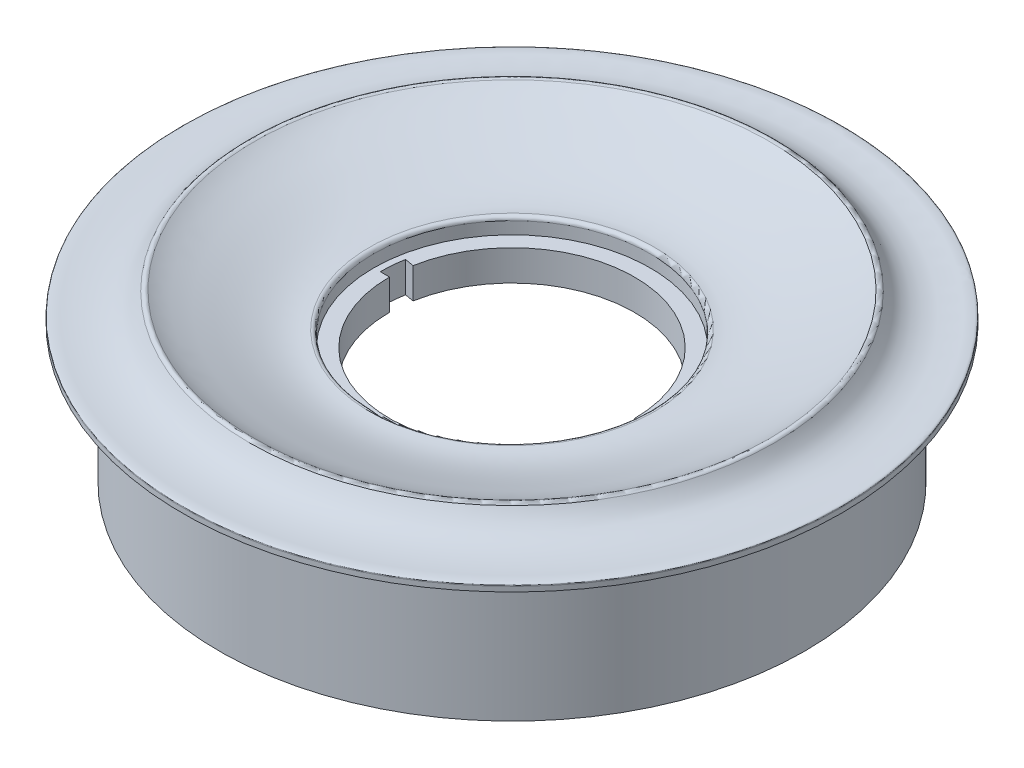
ISO-10303-21;
HEADER;
FILE_DESCRIPTION(('STEP AP214'),'2;1');
FILE_NAME('part.step','',(''),(''),'','','');
FILE_SCHEMA(('AUTOMOTIVE_DESIGN { 1 0 10303 214 1 1 1 1 }'));
ENDSEC;
DATA;
#1=APPLICATION_CONTEXT('core data for automotive mechanical design processes');
#2=APPLICATION_PROTOCOL_DEFINITION('international standard','automotive_design',2000,#1);
#3=PRODUCT_CONTEXT('',#1,'mechanical');
#4=PRODUCT('Part','Part','',(#3));
#5=PRODUCT_RELATED_PRODUCT_CATEGORY('part','',(#4));
#6=PRODUCT_DEFINITION_FORMATION('','',#4);
#7=PRODUCT_DEFINITION_CONTEXT('part definition',#1,'design');
#8=PRODUCT_DEFINITION('design','',#6,#7);
#9=PRODUCT_DEFINITION_SHAPE('','',#8);
#10=(LENGTH_UNIT() NAMED_UNIT(*) SI_UNIT(.MILLI.,.METRE.));
#11=(NAMED_UNIT(*) PLANE_ANGLE_UNIT() SI_UNIT($,.RADIAN.));
#12=(NAMED_UNIT(*) SI_UNIT($,.STERADIAN.) SOLID_ANGLE_UNIT());
#13=UNCERTAINTY_MEASURE_WITH_UNIT(LENGTH_MEASURE(1.E-05),#10,'distance_accuracy_value','');
#14=(GEOMETRIC_REPRESENTATION_CONTEXT(3) GLOBAL_UNCERTAINTY_ASSIGNED_CONTEXT((#13)) GLOBAL_UNIT_ASSIGNED_CONTEXT((#10,
#11,#12)) REPRESENTATION_CONTEXT('',''));
#15=CARTESIAN_POINT('',(0.,0.,0.));
#16=DIRECTION('',(0.,0.,1.));
#17=DIRECTION('',(1.,0.,0.));
#18=AXIS2_PLACEMENT_3D('',#15,#16,#17);
#19=CARTESIAN_POINT('',(0.,6.34999999999999,0.));
#20=DIRECTION('',(0.,1.,0.));
#21=DIRECTION('',(-1.,0.,0.));
#22=AXIS2_PLACEMENT_3D('',#19,#20,#21);
#23=PLANE('',#22);
#24=CARTESIAN_POINT('',(0.,6.34999999999999,0.));
#25=DIRECTION('',(0.,-1.,0.));
#26=DIRECTION('',(1.,0.,0.));
#27=AXIS2_PLACEMENT_3D('',#24,#25,#26);
#28=CIRCLE('',#27,28.6701753059719);
#29=CARTESIAN_POINT('',(28.6701753059719,6.35,0.));
#30=VERTEX_POINT('',#29);
#31=EDGE_CURVE('E198',#30,#30,#28,.T.);
#32=ORIENTED_EDGE('',*,*,#31,.F.);
#33=EDGE_LOOP('',(#32));
#34=FACE_BOUND('',#33,.T.);
#35=CARTESIAN_POINT('',(0.,6.34999999999999,0.));
#36=DIRECTION('',(0.,1.,0.));
#37=DIRECTION('',(-1.,0.,0.));
#38=AXIS2_PLACEMENT_3D('',#35,#36,#37);
#39=CIRCLE('',#38,27.305);
#40=CARTESIAN_POINT('',(26.8763736037759,6.35,4.81908361727159));
#41=VERTEX_POINT('',#40);
#42=CARTESIAN_POINT('',(27.305,6.35,0.));
#43=VERTEX_POINT('',#42);
#44=EDGE_CURVE('E102',#41,#43,#39,.T.);
#45=ORIENTED_EDGE('',*,*,#44,.F.);
#46=DIRECTION('',(-0.984302274447022,0.,-0.17649088508594));
#47=VECTOR('',#46,1.);
#48=CARTESIAN_POINT('',(0.,6.34999999999999,0.));
#49=LINE('',#48,#47);
#50=CARTESIAN_POINT('',(25.0012777709544,6.35,4.48286848118287));
#51=VERTEX_POINT('',#50);
#52=EDGE_CURVE('E110',#41,#51,#49,.T.);
#53=ORIENTED_EDGE('',*,*,#52,.T.);
#54=CARTESIAN_POINT('',(0.,6.34999999999999,0.));
#55=DIRECTION('',(0.,-1.,0.));
#56=DIRECTION('',(1.,0.,0.));
#57=AXIS2_PLACEMENT_3D('',#54,#55,#56);
#58=CIRCLE('',#57,25.4);
#59=CARTESIAN_POINT('',(-25.4,6.34999999999999,0.));
#60=VERTEX_POINT('',#59);
#61=EDGE_CURVE('E232',#51,#60,#58,.T.);
#62=ORIENTED_EDGE('',*,*,#61,.T.);
#63=DIRECTION('',(-1.,0.,0.));
#64=VECTOR('',#63,1.);
#65=CARTESIAN_POINT('',(0.,6.34999999999999,0.));
#66=LINE('',#65,#64);
#67=CARTESIAN_POINT('',(-27.305,6.34999999999999,0.));
#68=VERTEX_POINT('',#67);
#69=EDGE_CURVE('E131',#60,#68,#66,.T.);
#70=ORIENTED_EDGE('',*,*,#69,.T.);
#71=CARTESIAN_POINT('',(0.,6.34999999999999,0.));
#72=DIRECTION('',(0.,1.,0.));
#73=DIRECTION('',(-1.,0.,0.));
#74=AXIS2_PLACEMENT_3D('',#71,#72,#73);
#75=CIRCLE('',#74,27.305);
#76=CARTESIAN_POINT('',(-26.876373603776,6.34999999999999,-4.81908361727159));
#77=VERTEX_POINT('',#76);
#78=EDGE_CURVE('E129',#77,#68,#75,.T.);
#79=ORIENTED_EDGE('',*,*,#78,.F.);
#80=DIRECTION('',(-0.984302274447022,0.,-0.17649088508594));
#81=VECTOR('',#80,1.);
#82=CARTESIAN_POINT('',(0.,6.34999999999999,0.));
#83=LINE('',#82,#81);
#84=CARTESIAN_POINT('',(-25.0012777709544,6.34999999999999,-4.48286848118287));
#85=VERTEX_POINT('',#84);
#86=EDGE_CURVE('E122',#85,#77,#83,.T.);
#87=ORIENTED_EDGE('',*,*,#86,.F.);
#88=CARTESIAN_POINT('',(25.4,6.35,0.));
#89=VERTEX_POINT('',#88);
#90=EDGE_CURVE('E208',#85,#89,#58,.T.);
#91=ORIENTED_EDGE('',*,*,#90,.T.);
#92=DIRECTION('',(-1.,0.,0.));
#93=VECTOR('',#92,1.);
#94=CARTESIAN_POINT('',(0.,6.34999999999999,0.));
#95=LINE('',#94,#93);
#96=EDGE_CURVE('E107',#43,#89,#95,.T.);
#97=ORIENTED_EDGE('',*,*,#96,.F.);
#98=EDGE_LOOP('',(#45,#53,#62,#70,#79,#87,#91,#97));
#99=FACE_BOUND('',#98,.T.);
#100=ADVANCED_FACE('F34',(#34,#99),#23,.T.);
#101=CARTESIAN_POINT('',(0.,-26.8587837837838,0.));
#102=DIRECTION('',(0.,-1.,0.));
#103=DIRECTION('',(1.,0.,0.));
#104=AXIS2_PLACEMENT_3D('',#101,#102,#103);
#105=CYLINDRICAL_SURFACE('',#104,25.4);
#106=ORIENTED_EDGE('',*,*,#61,.F.);
#107=DIRECTION('',(0.,1.,0.));
#108=VECTOR('',#107,1.);
#109=CARTESIAN_POINT('',(25.0012777709544,-19.05,4.48286848118287));
#110=LINE('',#109,#108);
#111=CARTESIAN_POINT('',(25.0012777709544,0.,4.48286848118287));
#112=VERTEX_POINT('',#111);
#113=EDGE_CURVE('E113',#112,#51,#110,.T.);
#114=ORIENTED_EDGE('',*,*,#113,.F.);
#115=CARTESIAN_POINT('',(0.,0.,0.));
#116=DIRECTION('',(0.,-1.,0.));
#117=DIRECTION('',(1.,0.,0.));
#118=AXIS2_PLACEMENT_3D('',#115,#116,#117);
#119=CIRCLE('',#118,25.4);
#120=CARTESIAN_POINT('',(-25.4,0.,0.));
#121=VERTEX_POINT('',#120);
#122=EDGE_CURVE('E230',#112,#121,#119,.T.);
#123=ORIENTED_EDGE('',*,*,#122,.T.);
#124=DIRECTION('',(0.,1.,0.));
#125=VECTOR('',#124,1.);
#126=CARTESIAN_POINT('',(-25.4,-19.05,0.));
#127=LINE('',#126,#125);
#128=EDGE_CURVE('E138',#121,#60,#127,.T.);
#129=ORIENTED_EDGE('',*,*,#128,.T.);
#130=EDGE_LOOP('',(#106,#114,#123,#129));
#131=FACE_BOUND('',#130,.T.);
#132=ADVANCED_FACE('F175',(#131),#105,.F.);
#133=CARTESIAN_POINT('',(0.,0.,0.));
#134=DIRECTION('',(0.,-1.,0.));
#135=DIRECTION('',(1.,0.,0.));
#136=AXIS2_PLACEMENT_3D('',#133,#134,#135);
#137=PLANE('',#136);
#138=CARTESIAN_POINT('',(0.,0.,0.));
#139=DIRECTION('',(0.,-1.,0.));
#140=DIRECTION('',(1.,0.,0.));
#141=AXIS2_PLACEMENT_3D('',#138,#139,#140);
#142=CIRCLE('',#141,27.94);
#143=CARTESIAN_POINT('',(27.94,0.,0.));
#144=VERTEX_POINT('',#143);
#145=EDGE_CURVE('E237',#144,#144,#142,.T.);
#146=ORIENTED_EDGE('',*,*,#145,.T.);
#147=EDGE_LOOP('',(#146));
#148=FACE_BOUND('',#147,.T.);
#149=ORIENTED_EDGE('',*,*,#122,.F.);
#150=DIRECTION('',(0.984302274447023,0.,0.17649088508594));
#151=VECTOR('',#150,1.);
#152=CARTESIAN_POINT('',(0.,0.,0.));
#153=LINE('',#152,#151);
#154=CARTESIAN_POINT('',(26.8763736037759,0.,4.81908361727159));
#155=VERTEX_POINT('',#154);
#156=EDGE_CURVE('E11',#112,#155,#153,.T.);
#157=ORIENTED_EDGE('',*,*,#156,.T.);
#158=CARTESIAN_POINT('',(0.,0.,0.));
#159=DIRECTION('',(0.,-1.,0.));
#160=DIRECTION('',(1.,0.,0.));
#161=AXIS2_PLACEMENT_3D('',#158,#159,#160);
#162=CIRCLE('',#161,27.305);
#163=CARTESIAN_POINT('',(27.305,0.,0.));
#164=VERTEX_POINT('',#163);
#165=EDGE_CURVE('E105',#164,#155,#162,.T.);
#166=ORIENTED_EDGE('',*,*,#165,.F.);
#167=DIRECTION('',(1.,0.,0.));
#168=VECTOR('',#167,1.);
#169=CARTESIAN_POINT('',(0.,0.,0.));
#170=LINE('',#169,#168);
#171=CARTESIAN_POINT('',(25.4,0.,0.));
#172=VERTEX_POINT('',#171);
#173=EDGE_CURVE('E43',#172,#164,#170,.T.);
#174=ORIENTED_EDGE('',*,*,#173,.F.);
#175=CARTESIAN_POINT('',(-25.0012777709544,0.,-4.48286848118287));
#176=VERTEX_POINT('',#175);
#177=EDGE_CURVE('E234',#176,#172,#119,.T.);
#178=ORIENTED_EDGE('',*,*,#177,.F.);
#179=DIRECTION('',(0.984302274447023,0.,0.17649088508594));
#180=VECTOR('',#179,1.);
#181=CARTESIAN_POINT('',(0.,0.,0.));
#182=LINE('',#181,#180);
#183=CARTESIAN_POINT('',(-26.876373603776,0.,-4.81908361727159));
#184=VERTEX_POINT('',#183);
#185=EDGE_CURVE('E221',#184,#176,#182,.T.);
#186=ORIENTED_EDGE('',*,*,#185,.F.);
#187=CARTESIAN_POINT('',(0.,0.,0.));
#188=DIRECTION('',(0.,-1.,0.));
#189=DIRECTION('',(1.,0.,0.));
#190=AXIS2_PLACEMENT_3D('',#187,#188,#189);
#191=CIRCLE('',#190,27.305);
#192=CARTESIAN_POINT('',(-27.305,0.,0.));
#193=VERTEX_POINT('',#192);
#194=EDGE_CURVE('E216',#193,#184,#191,.T.);
#195=ORIENTED_EDGE('',*,*,#194,.F.);
#196=DIRECTION('',(1.,0.,0.));
#197=VECTOR('',#196,1.);
#198=CARTESIAN_POINT('',(0.,0.,0.));
#199=LINE('',#198,#197);
#200=EDGE_CURVE('E218',#193,#121,#199,.T.);
#201=ORIENTED_EDGE('',*,*,#200,.T.);
#202=EDGE_LOOP('',(#149,#157,#166,#174,#178,#186,#195,#201));
#203=FACE_BOUND('',#202,.T.);
#204=ADVANCED_FACE('F170',(#148,#203),#137,.T.);
#205=CARTESIAN_POINT('',(54.4334172981673,16.4923987097209,0.));
#206=CARTESIAN_POINT('',(55.1403293875496,15.4008010122186,0.));
#207=CARTESIAN_POINT('',(56.6341226849523,13.4533803086591,0.));
#208=CARTESIAN_POINT('',(61.084980839576,11.9245329677404,0.));
#209=CARTESIAN_POINT('',(65.0465233733237,12.1539748647627,0.));
#210=CARTESIAN_POINT('',(67.3586956970523,12.3329258300038,0.));
#211=CARTESIAN_POINT('',(68.2555609697031,12.1813969285362,0.));
#212=CARTESIAN_POINT('',(68.3016513023438,11.9856092782213,0.));
#213=B_SPLINE_CURVE_WITH_KNOTS('',3,(#205,#206,#207,#208,#209,#210,#211,#212),.UNSPECIFIED.,.F.,
.F.,(4,1,1,1,1,4),(0.0324838300644104,0.240160522416409,0.498483461622623,0.829405314364627,
0.925193366866748,0.958836686646968),.UNSPECIFIED.);
#214=CARTESIAN_POINT('',(0.,-26.8587837837838,0.));
#215=DIRECTION('',(0.,-1.,0.));
#216=AXIS1_PLACEMENT('',#214,#215);
#217=SURFACE_OF_REVOLUTION('',#213,#216);
#218=CARTESIAN_POINT('',(0.,11.9856092782213,0.));
#219=DIRECTION('',(0.,-1.,0.));
#220=DIRECTION('',(1.,0.,0.));
#221=AXIS2_PLACEMENT_3D('',#218,#219,#220);
#222=CIRCLE('',#221,68.3016513023439);
#223=CARTESIAN_POINT('',(68.3016513023438,11.9856092782213,0.));
#224=VERTEX_POINT('',#223);
#225=EDGE_CURVE('E137',#224,#224,#222,.T.);
#226=ORIENTED_EDGE('',*,*,#225,.F.);
#227=EDGE_LOOP('',(#226));
#228=FACE_BOUND('',#227,.T.);
#229=CARTESIAN_POINT('',(0.,16.4923987097209,0.));
#230=DIRECTION('',(0.,-1.,0.));
#231=DIRECTION('',(1.,0.,0.));
#232=AXIS2_PLACEMENT_3D('',#229,#230,#231);
#233=CIRCLE('',#232,54.4334172981673);
#234=CARTESIAN_POINT('',(54.4334172981673,16.4923987097209,0.));
#235=VERTEX_POINT('',#234);
#236=EDGE_CURVE('E213',#235,#235,#233,.T.);
#237=ORIENTED_EDGE('',*,*,#236,.T.);
#238=EDGE_LOOP('',(#237));
#239=FACE_BOUND('',#238,.T.);
#240=ADVANCED_FACE('F36',(#228,#239),#217,.T.);
#241=CARTESIAN_POINT('',(0.,16.0782,0.));
#242=DIRECTION('',(0.,-1.,0.));
#243=DIRECTION('',(1.,0.,0.));
#244=AXIS2_PLACEMENT_3D('',#241,#242,#243);
#245=TOROIDAL_SURFACE('',#244,53.7938209966883,0.761999999999999);
#246=CARTESIAN_POINT('',(0.,16.7131508980544,0.));
#247=DIRECTION('',(0.,-1.,0.));
#248=DIRECTION('',(1.,0.,0.));
#249=AXIS2_PLACEMENT_3D('',#246,#247,#248);
#250=CIRCLE('',#249,53.3725356337099);
#251=CARTESIAN_POINT('',(53.3725356337099,16.7131508980544,0.));
#252=VERTEX_POINT('',#251);
#253=EDGE_CURVE('E206',#252,#252,#250,.T.);
#254=ORIENTED_EDGE('',*,*,#253,.T.);
#255=EDGE_LOOP('',(#254));
#256=FACE_BOUND('',#255,.T.);
#257=ORIENTED_EDGE('',*,*,#236,.F.);
#258=EDGE_LOOP('',(#257));
#259=FACE_BOUND('',#258,.T.);
#260=ADVANCED_FACE('F162',(#256,#259),#245,.T.);
#261=CARTESIAN_POINT('',(29.5281601562089,9.64593049186085,0.));
#262=CARTESIAN_POINT('',(32.3548326146096,9.28701160247665,0.));
#263=CARTESIAN_POINT('',(37.8008383729279,10.3000250220282,0.));
#264=CARTESIAN_POINT('',(43.8116199334136,12.5138342862572,0.));
#265=CARTESIAN_POINT('',(48.9714829665233,14.4254353909202,0.));
#266=CARTESIAN_POINT('',(51.7719979555551,15.6512056377697,0.));
#267=CARTESIAN_POINT('',(53.3725356337099,16.7131508980544,0.));
#268=B_SPLINE_CURVE_WITH_KNOTS('',3,(#261,#262,#263,#264,#265,#266,#267),.UNSPECIFIED.,.F.,.F.,
(4,1,1,1,4),(0.0307658621855829,0.353803290986322,0.633803768632881,0.758492974897343,
0.975529832886141),.UNSPECIFIED.);
#269=CARTESIAN_POINT('',(0.,-26.8587837837838,0.));
#270=DIRECTION('',(0.,-1.,0.));
#271=AXIS1_PLACEMENT('',#269,#270);
#272=SURFACE_OF_REVOLUTION('',#268,#271);
#273=ORIENTED_EDGE('',*,*,#253,.F.);
#274=EDGE_LOOP('',(#273));
#275=FACE_BOUND('',#274,.T.);
#276=CARTESIAN_POINT('',(0.,9.64593049186085,0.));
#277=DIRECTION('',(0.,-1.,0.));
#278=DIRECTION('',(1.,0.,0.));
#279=AXIS2_PLACEMENT_3D('',#276,#277,#278);
#280=CIRCLE('',#279,29.5281601562089);
#281=CARTESIAN_POINT('',(29.5281601562089,9.64593049186085,0.));
#282=VERTEX_POINT('',#281);
#283=EDGE_CURVE('E203',#282,#282,#280,.T.);
#284=ORIENTED_EDGE('',*,*,#283,.T.);
#285=EDGE_LOOP('',(#284));
#286=FACE_BOUND('',#285,.T.);
#287=ADVANCED_FACE('F158',(#275,#286),#272,.T.);
#288=CARTESIAN_POINT('',(0.,8.88999999999999,0.));
#289=DIRECTION('',(0.,-1.,0.));
#290=DIRECTION('',(1.,0.,0.));
#291=AXIS2_PLACEMENT_3D('',#288,#289,#290);
#292=TOROIDAL_SURFACE('',#291,29.4321753059719,0.762);
#293=ORIENTED_EDGE('',*,*,#283,.F.);
#294=EDGE_LOOP('',(#293));
#295=FACE_BOUND('',#294,.T.);
#296=CARTESIAN_POINT('',(0.,8.89,0.));
#297=DIRECTION('',(0.,-1.,0.));
#298=DIRECTION('',(1.,0.,0.));
#299=AXIS2_PLACEMENT_3D('',#296,#297,#298);
#300=CIRCLE('',#299,28.6701753059719);
#301=CARTESIAN_POINT('',(28.6701753059719,8.89,0.));
#302=VERTEX_POINT('',#301);
#303=EDGE_CURVE('E201',#302,#302,#300,.T.);
#304=ORIENTED_EDGE('',*,*,#303,.T.);
#305=EDGE_LOOP('',(#304));
#306=FACE_BOUND('',#305,.T.);
#307=ADVANCED_FACE('F161',(#295,#306),#292,.T.);
#308=CARTESIAN_POINT('',(0.,-26.8587837837838,0.));
#309=DIRECTION('',(0.,-1.,0.));
#310=DIRECTION('',(1.,0.,0.));
#311=AXIS2_PLACEMENT_3D('',#308,#309,#310);
#312=CYLINDRICAL_SURFACE('',#311,28.6701753059719);
#313=ORIENTED_EDGE('',*,*,#31,.T.);
#314=EDGE_LOOP('',(#313));
#315=FACE_BOUND('',#314,.T.);
#316=ORIENTED_EDGE('',*,*,#303,.F.);
#317=EDGE_LOOP('',(#316));
#318=FACE_BOUND('',#317,.T.);
#319=ADVANCED_FACE('F186',(#315,#318),#312,.F.);
#320=DIRECTION('',(0.,1.,0.));
#321=VECTOR('',#320,1.);
#322=CARTESIAN_POINT('',(25.4,-19.05,0.));
#323=LINE('',#322,#321);
#324=EDGE_CURVE('E123',#172,#89,#323,.T.);
#325=ORIENTED_EDGE('',*,*,#324,.T.);
#326=ORIENTED_EDGE('',*,*,#90,.F.);
#327=DIRECTION('',(0.,1.,0.));
#328=VECTOR('',#327,1.);
#329=CARTESIAN_POINT('',(-25.0012777709544,-19.05,-4.48286848118287));
#330=LINE('',#329,#328);
#331=EDGE_CURVE('E135',#176,#85,#330,.T.);
#332=ORIENTED_EDGE('',*,*,#331,.F.);
#333=ORIENTED_EDGE('',*,*,#177,.T.);
#334=EDGE_LOOP('',(#325,#326,#332,#333));
#335=FACE_BOUND('',#334,.T.);
#336=ADVANCED_FACE('F183',(#335),#105,.F.);
#337=CARTESIAN_POINT('',(0.,-26.8587837837838,0.));
#338=DIRECTION('',(0.,-1.,0.));
#339=DIRECTION('',(1.,0.,0.));
#340=AXIS2_PLACEMENT_3D('',#337,#338,#339);
#341=CYLINDRICAL_SURFACE('',#340,27.94);
#342=CARTESIAN_POINT('',(0.,3.81,0.));
#343=DIRECTION('',(0.,-1.,0.));
#344=DIRECTION('',(1.,0.,0.));
#345=AXIS2_PLACEMENT_3D('',#342,#343,#344);
#346=CIRCLE('',#345,27.94);
#347=CARTESIAN_POINT('',(27.94,3.81,0.));
#348=VERTEX_POINT('',#347);
#349=EDGE_CURVE('E240',#348,#348,#346,.T.);
#350=ORIENTED_EDGE('',*,*,#349,.T.);
#351=EDGE_LOOP('',(#350));
#352=FACE_BOUND('',#351,.T.);
#353=ORIENTED_EDGE('',*,*,#145,.F.);
#354=EDGE_LOOP('',(#353));
#355=FACE_BOUND('',#354,.T.);
#356=ADVANCED_FACE('F193',(#352,#355),#341,.T.);
#357=CARTESIAN_POINT('',(0.,3.80999999999999,0.));
#358=DIRECTION('',(0.,-1.,0.));
#359=DIRECTION('',(1.,0.,0.));
#360=AXIS2_PLACEMENT_3D('',#357,#358,#359);
#361=PLANE('',#360);
#362=CARTESIAN_POINT('',(0.,3.80999999999999,0.));
#363=DIRECTION('',(0.,-1.,0.));
#364=DIRECTION('',(1.,0.,0.));
#365=AXIS2_PLACEMENT_3D('',#362,#363,#364);
#366=CIRCLE('',#365,31.75);
#367=CARTESIAN_POINT('',(31.75,3.81,0.));
#368=VERTEX_POINT('',#367);
#369=EDGE_CURVE('E243',#368,#368,#366,.T.);
#370=ORIENTED_EDGE('',*,*,#369,.T.);
#371=EDGE_LOOP('',(#370));
#372=FACE_BOUND('',#371,.T.);
#373=ORIENTED_EDGE('',*,*,#349,.F.);
#374=EDGE_LOOP('',(#373));
#375=FACE_BOUND('',#374,.T.);
#376=ADVANCED_FACE('F319',(#372,#375),#361,.T.);
#377=CARTESIAN_POINT('',(0.,-26.8587837837838,0.));
#378=DIRECTION('',(0.,-1.,0.));
#379=DIRECTION('',(1.,0.,0.));
#380=AXIS2_PLACEMENT_3D('',#377,#378,#379);
#381=CYLINDRICAL_SURFACE('',#380,31.75);
#382=CARTESIAN_POINT('',(0.,7.61999999999999,0.));
#383=DIRECTION('',(0.,-1.,0.));
#384=DIRECTION('',(1.,0.,0.));
#385=AXIS2_PLACEMENT_3D('',#382,#383,#384);
#386=CIRCLE('',#385,31.75);
#387=CARTESIAN_POINT('',(31.75,7.62,0.));
#388=VERTEX_POINT('',#387);
#389=EDGE_CURVE('E246',#388,#388,#386,.T.);
#390=ORIENTED_EDGE('',*,*,#389,.T.);
#391=EDGE_LOOP('',(#390));
#392=FACE_BOUND('',#391,.T.);
#393=ORIENTED_EDGE('',*,*,#369,.F.);
#394=EDGE_LOOP('',(#393));
#395=FACE_BOUND('',#394,.T.);
#396=ADVANCED_FACE('F315',(#392,#395),#381,.T.);
#397=CARTESIAN_POINT('',(0.,7.61999999999999,0.));
#398=DIRECTION('',(0.,1.,0.));
#399=DIRECTION('',(-1.,0.,0.));
#400=AXIS2_PLACEMENT_3D('',#397,#398,#399);
#401=CONICAL_SURFACE('',#400,31.75,1.2323747869996);
#402=CARTESIAN_POINT('',(0.,15.081797010964,0.));
#403=DIRECTION('',(0.,-1.,0.));
#404=DIRECTION('',(1.,0.,0.));
#405=AXIS2_PLACEMENT_3D('',#402,#403,#404);
#406=CIRCLE('',#405,52.9505819824219);
#407=CARTESIAN_POINT('',(52.9505819824219,15.081797010964,0.));
#408=VERTEX_POINT('',#407);
#409=EDGE_CURVE('E249',#408,#408,#406,.T.);
#410=ORIENTED_EDGE('',*,*,#409,.T.);
#411=EDGE_LOOP('',(#410));
#412=FACE_BOUND('',#411,.T.);
#413=ORIENTED_EDGE('',*,*,#389,.F.);
#414=EDGE_LOOP('',(#413));
#415=FACE_BOUND('',#414,.T.);
#416=ADVANCED_FACE('F311',(#412,#415),#401,.T.);
#417=CARTESIAN_POINT('',(0.,15.081797010964,0.));
#418=DIRECTION('',(0.,-1.,0.));
#419=DIRECTION('',(1.,0.,0.));
#420=AXIS2_PLACEMENT_3D('',#417,#418,#419);
#421=CONICAL_SURFACE('',#420,52.9505819824219,0.901965786478076);
#422=CARTESIAN_POINT('',(0.,10.16,0.));
#423=DIRECTION('',(0.,-1.,0.));
#424=DIRECTION('',(1.,0.,0.));
#425=AXIS2_PLACEMENT_3D('',#422,#423,#424);
#426=CIRCLE('',#425,59.1779265555819);
#427=CARTESIAN_POINT('',(59.1779265555819,10.16,0.));
#428=VERTEX_POINT('',#427);
#429=EDGE_CURVE('E252',#428,#428,#426,.T.);
#430=ORIENTED_EDGE('',*,*,#429,.T.);
#431=EDGE_LOOP('',(#430));
#432=FACE_BOUND('',#431,.T.);
#433=ORIENTED_EDGE('',*,*,#409,.F.);
#434=EDGE_LOOP('',(#433));
#435=FACE_BOUND('',#434,.T.);
#436=ADVANCED_FACE('F307',(#432,#435),#421,.F.);
#437=CARTESIAN_POINT('',(0.,-26.8587837837838,0.));
#438=DIRECTION('',(0.,-1.,0.));
#439=DIRECTION('',(1.,0.,0.));
#440=AXIS2_PLACEMENT_3D('',#437,#438,#439);
#441=CYLINDRICAL_SURFACE('',#440,59.1779265555819);
#442=CARTESIAN_POINT('',(0.,-17.78,0.));
#443=DIRECTION('',(0.,-1.,0.));
#444=DIRECTION('',(1.,0.,0.));
#445=AXIS2_PLACEMENT_3D('',#442,#443,#444);
#446=CIRCLE('',#445,59.1779265555819);
#447=CARTESIAN_POINT('',(59.1779265555819,-17.78,0.));
#448=VERTEX_POINT('',#447);
#449=EDGE_CURVE('E255',#448,#448,#446,.T.);
#450=ORIENTED_EDGE('',*,*,#449,.T.);
#451=EDGE_LOOP('',(#450));
#452=FACE_BOUND('',#451,.T.);
#453=ORIENTED_EDGE('',*,*,#429,.F.);
#454=EDGE_LOOP('',(#453));
#455=FACE_BOUND('',#454,.T.);
#456=ADVANCED_FACE('F303',(#452,#455),#441,.F.);
#457=CARTESIAN_POINT('',(0.,-17.78,0.));
#458=DIRECTION('',(0.,-1.,0.));
#459=DIRECTION('',(1.,0.,0.));
#460=AXIS2_PLACEMENT_3D('',#457,#458,#459);
#461=PLANE('',#460);
#462=CARTESIAN_POINT('',(0.,-17.78,0.));
#463=DIRECTION('',(0.,-1.,0.));
#464=DIRECTION('',(1.,0.,0.));
#465=AXIS2_PLACEMENT_3D('',#462,#463,#464);
#466=CIRCLE('',#465,60.7019265555819);
#467=CARTESIAN_POINT('',(60.7019265555819,-17.78,0.));
#468=VERTEX_POINT('',#467);
#469=EDGE_CURVE('E258',#468,#468,#466,.T.);
#470=ORIENTED_EDGE('',*,*,#469,.T.);
#471=EDGE_LOOP('',(#470));
#472=FACE_BOUND('',#471,.T.);
#473=ORIENTED_EDGE('',*,*,#449,.F.);
#474=EDGE_LOOP('',(#473));
#475=FACE_BOUND('',#474,.T.);
#476=ADVANCED_FACE('F299',(#472,#475),#461,.T.);
#477=CARTESIAN_POINT('',(0.,-26.8587837837838,0.));
#478=DIRECTION('',(0.,-1.,0.));
#479=DIRECTION('',(1.,0.,0.));
#480=AXIS2_PLACEMENT_3D('',#477,#478,#479);
#481=CYLINDRICAL_SURFACE('',#480,60.7019265555819);
#482=CARTESIAN_POINT('',(0.,10.795,0.));
#483=DIRECTION('',(0.,-1.,0.));
#484=DIRECTION('',(1.,0.,0.));
#485=AXIS2_PLACEMENT_3D('',#482,#483,#484);
#486=CIRCLE('',#485,60.7019265555819);
#487=CARTESIAN_POINT('',(60.7019265555819,10.795,0.));
#488=VERTEX_POINT('',#487);
#489=EDGE_CURVE('E261',#488,#488,#486,.T.);
#490=ORIENTED_EDGE('',*,*,#489,.T.);
#491=EDGE_LOOP('',(#490));
#492=FACE_BOUND('',#491,.T.);
#493=ORIENTED_EDGE('',*,*,#469,.F.);
#494=EDGE_LOOP('',(#493));
#495=FACE_BOUND('',#494,.T.);
#496=ADVANCED_FACE('F295',(#492,#495),#481,.T.);
#497=CARTESIAN_POINT('',(0.,10.795,0.));
#498=DIRECTION('',(0.,-1.,0.));
#499=DIRECTION('',(1.,0.,0.));
#500=AXIS2_PLACEMENT_3D('',#497,#498,#499);
#501=PLANE('',#500);
#502=CARTESIAN_POINT('',(0.,10.795,0.));
#503=DIRECTION('',(0.,-1.,0.));
#504=DIRECTION('',(1.,0.,0.));
#505=AXIS2_PLACEMENT_3D('',#502,#503,#504);
#506=CIRCLE('',#505,68.3219265555819);
#507=CARTESIAN_POINT('',(68.3219265555819,10.795,0.));
#508=VERTEX_POINT('',#507);
#509=EDGE_CURVE('E264',#508,#508,#506,.T.);
#510=ORIENTED_EDGE('',*,*,#509,.T.);
#511=EDGE_LOOP('',(#510));
#512=FACE_BOUND('',#511,.T.);
#513=ORIENTED_EDGE('',*,*,#489,.F.);
#514=EDGE_LOOP('',(#513));
#515=FACE_BOUND('',#514,.T.);
#516=ADVANCED_FACE('F288',(#512,#515),#501,.T.);
#517=CARTESIAN_POINT('',(0.,-26.8587837837838,0.));
#518=DIRECTION('',(0.,-1.,0.));
#519=DIRECTION('',(1.,0.,0.));
#520=AXIS2_PLACEMENT_3D('',#517,#518,#519);
#521=CYLINDRICAL_SURFACE('',#520,68.3219265555819);
#522=ORIENTED_EDGE('',*,*,#509,.F.);
#523=EDGE_LOOP('',(#522));
#524=FACE_BOUND('',#523,.T.);
#525=CARTESIAN_POINT('',(0.,11.811,0.));
#526=DIRECTION('',(0.,-1.,0.));
#527=DIRECTION('',(1.,0.,0.));
#528=AXIS2_PLACEMENT_3D('',#525,#526,#527);
#529=CIRCLE('',#528,68.3219265555819);
#530=CARTESIAN_POINT('',(68.3219265555819,11.811,0.));
#531=VERTEX_POINT('',#530);
#532=EDGE_CURVE('E266',#531,#531,#529,.T.);
#533=ORIENTED_EDGE('',*,*,#532,.T.);
#534=EDGE_LOOP('',(#533));
#535=FACE_BOUND('',#534,.T.);
#536=ADVANCED_FACE('F278',(#524,#535),#521,.T.);
#537=CARTESIAN_POINT('',(0.,11.811,0.));
#538=DIRECTION('',(0.,-1.,0.));
#539=DIRECTION('',(1.,0.,0.));
#540=AXIS2_PLACEMENT_3D('',#537,#538,#539);
#541=TOROIDAL_SURFACE('',#540,67.5599265555819,0.762000000000008);
#542=ORIENTED_EDGE('',*,*,#532,.F.);
#543=EDGE_LOOP('',(#542));
#544=FACE_BOUND('',#543,.T.);
#545=ORIENTED_EDGE('',*,*,#225,.T.);
#546=EDGE_LOOP('',(#545));
#547=FACE_BOUND('',#546,.T.);
#548=ADVANCED_FACE('F273',(#544,#547),#541,.T.);
#549=CARTESIAN_POINT('',(0.,-19.05,0.));
#550=DIRECTION('',(0.17649088508594,0.,-0.984302274447022));
#551=DIRECTION('',(-0.984302274447023,0.,-0.17649088508594));
#552=AXIS2_PLACEMENT_3D('',#549,#550,#551);
#553=PLANE('',#552);
#554=ORIENTED_EDGE('',*,*,#185,.T.);
#555=ORIENTED_EDGE('',*,*,#331,.T.);
#556=ORIENTED_EDGE('',*,*,#86,.T.);
#557=DIRECTION('',(0.,1.,0.));
#558=VECTOR('',#557,1.);
#559=CARTESIAN_POINT('',(-26.876373603776,-19.05,-4.81908361727159));
#560=LINE('',#559,#558);
#561=EDGE_CURVE('E134',#184,#77,#560,.T.);
#562=ORIENTED_EDGE('',*,*,#561,.F.);
#563=EDGE_LOOP('',(#554,#555,#556,#562));
#564=FACE_BOUND('',#563,.T.);
#565=ADVANCED_FACE('F277',(#564),#553,.F.);
#566=CARTESIAN_POINT('',(0.,-19.05,0.));
#567=DIRECTION('',(0.,0.,-1.));
#568=DIRECTION('',(-1.,0.,0.));
#569=AXIS2_PLACEMENT_3D('',#566,#567,#568);
#570=PLANE('',#569);
#571=DIRECTION('',(0.,1.,0.));
#572=VECTOR('',#571,1.);
#573=CARTESIAN_POINT('',(-27.305,-19.05,0.));
#574=LINE('',#573,#572);
#575=EDGE_CURVE('E58',#193,#68,#574,.T.);
#576=ORIENTED_EDGE('',*,*,#575,.T.);
#577=ORIENTED_EDGE('',*,*,#69,.F.);
#578=ORIENTED_EDGE('',*,*,#128,.F.);
#579=ORIENTED_EDGE('',*,*,#200,.F.);
#580=EDGE_LOOP('',(#576,#577,#578,#579));
#581=FACE_BOUND('',#580,.T.);
#582=ADVANCED_FACE('F285',(#581),#570,.T.);
#583=CARTESIAN_POINT('',(0.,-19.05,0.));
#584=DIRECTION('',(0.,1.,0.));
#585=DIRECTION('',(-1.,0.,0.));
#586=AXIS2_PLACEMENT_3D('',#583,#584,#585);
#587=CYLINDRICAL_SURFACE('',#586,27.305);
#588=ORIENTED_EDGE('',*,*,#194,.T.);
#589=ORIENTED_EDGE('',*,*,#561,.T.);
#590=ORIENTED_EDGE('',*,*,#78,.T.);
#591=ORIENTED_EDGE('',*,*,#575,.F.);
#592=EDGE_LOOP('',(#588,#589,#590,#591));
#593=FACE_BOUND('',#592,.T.);
#594=ADVANCED_FACE('F449',(#593),#587,.F.);
#595=CARTESIAN_POINT('',(0.,-19.05,0.));
#596=DIRECTION('',(0.17649088508594,0.,-0.984302274447022));
#597=DIRECTION('',(-0.984302274447023,0.,-0.17649088508594));
#598=AXIS2_PLACEMENT_3D('',#595,#596,#597);
#599=PLANE('',#598);
#600=ORIENTED_EDGE('',*,*,#113,.T.);
#601=ORIENTED_EDGE('',*,*,#52,.F.);
#602=DIRECTION('',(0.,1.,0.));
#603=VECTOR('',#602,1.);
#604=CARTESIAN_POINT('',(26.8763736037759,-19.05,4.81908361727159));
#605=LINE('',#604,#603);
#606=EDGE_CURVE('E98',#155,#41,#605,.T.);
#607=ORIENTED_EDGE('',*,*,#606,.F.);
#608=ORIENTED_EDGE('',*,*,#156,.F.);
#609=EDGE_LOOP('',(#600,#601,#607,#608));
#610=FACE_BOUND('',#609,.T.);
#611=ADVANCED_FACE('F111',(#610),#599,.T.);
#612=CARTESIAN_POINT('',(0.,-19.05,0.));
#613=DIRECTION('',(0.,0.,-1.));
#614=DIRECTION('',(-1.,0.,0.));
#615=AXIS2_PLACEMENT_3D('',#612,#613,#614);
#616=PLANE('',#615);
#617=ORIENTED_EDGE('',*,*,#173,.T.);
#618=DIRECTION('',(0.,1.,0.));
#619=VECTOR('',#618,1.);
#620=CARTESIAN_POINT('',(27.305,-19.05,0.));
#621=LINE('',#620,#619);
#622=EDGE_CURVE('E50',#164,#43,#621,.T.);
#623=ORIENTED_EDGE('',*,*,#622,.T.);
#624=ORIENTED_EDGE('',*,*,#96,.T.);
#625=ORIENTED_EDGE('',*,*,#324,.F.);
#626=EDGE_LOOP('',(#617,#623,#624,#625));
#627=FACE_BOUND('',#626,.T.);
#628=ADVANCED_FACE('F225',(#627),#616,.F.);
#629=CARTESIAN_POINT('',(0.,-19.05,0.));
#630=DIRECTION('',(0.,1.,0.));
#631=DIRECTION('',(-1.,0.,0.));
#632=AXIS2_PLACEMENT_3D('',#629,#630,#631);
#633=CYLINDRICAL_SURFACE('',#632,27.305);
#634=ORIENTED_EDGE('',*,*,#165,.T.);
#635=ORIENTED_EDGE('',*,*,#606,.T.);
#636=ORIENTED_EDGE('',*,*,#44,.T.);
#637=ORIENTED_EDGE('',*,*,#622,.F.);
#638=EDGE_LOOP('',(#634,#635,#636,#637));
#639=FACE_BOUND('',#638,.T.);
#640=ADVANCED_FACE('F100',(#639),#633,.F.);
#641=CLOSED_SHELL('',(#100,#132,#204,#240,#260,#287,#307,#319,#336,#356,#376,#396,#416,#436,
#456,#476,#496,#516,#536,#548,#565,#582,#594,#611,#628,#640));
#642=MANIFOLD_SOLID_BREP('B2',#641);
#643=ADVANCED_BREP_SHAPE_REPRESENTATION('',(#18,#642),#14);
#644=SHAPE_DEFINITION_REPRESENTATION(#9,#643);
ENDSEC;
END-ISO-10303-21;
